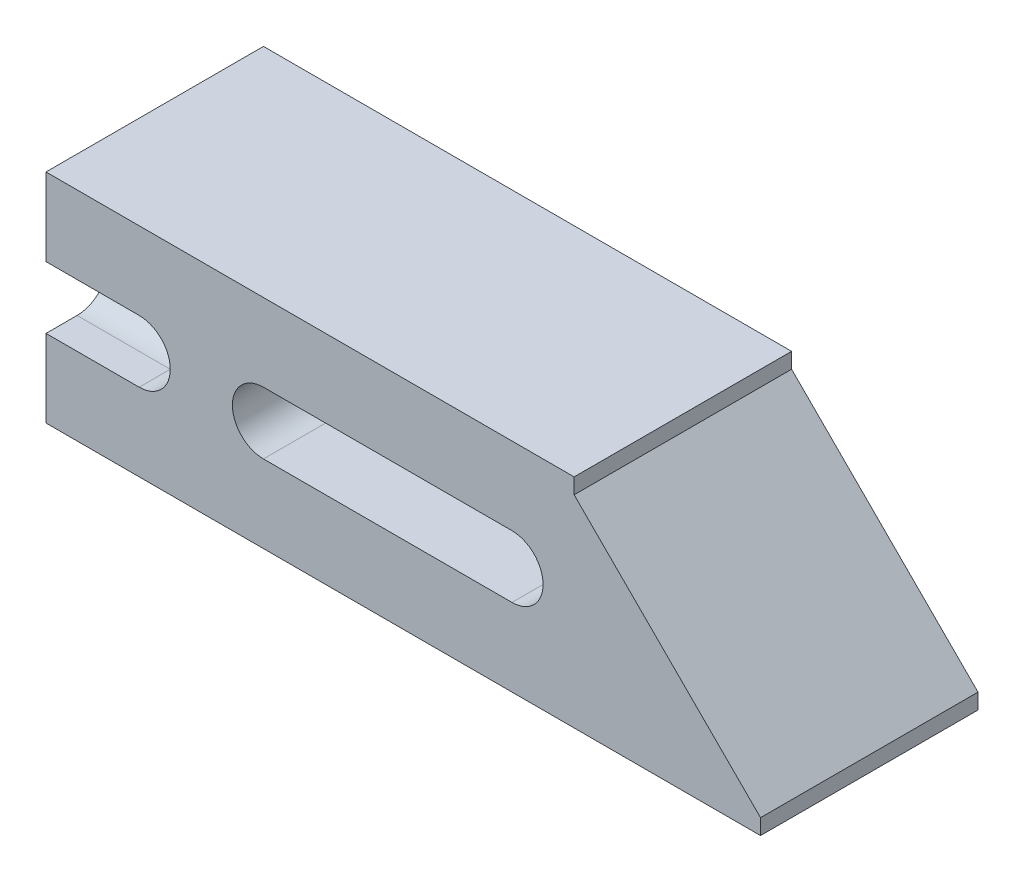
ISO-10303-21;
HEADER;
FILE_DESCRIPTION(('STEP AP214'),'2;1');
FILE_NAME('part.step','',(''),(''),'','','');
FILE_SCHEMA(('AUTOMOTIVE_DESIGN { 1 0 10303 214 1 1 1 1 }'));
ENDSEC;
DATA;
#1=APPLICATION_CONTEXT('core data for automotive mechanical design processes');
#2=APPLICATION_PROTOCOL_DEFINITION('international standard','automotive_design',2000,#1);
#3=PRODUCT_CONTEXT('',#1,'mechanical');
#4=PRODUCT('Part','Part','',(#3));
#5=PRODUCT_RELATED_PRODUCT_CATEGORY('part','',(#4));
#6=PRODUCT_DEFINITION_FORMATION('','',#4);
#7=PRODUCT_DEFINITION_CONTEXT('part definition',#1,'design');
#8=PRODUCT_DEFINITION('design','',#6,#7);
#9=PRODUCT_DEFINITION_SHAPE('','',#8);
#10=(LENGTH_UNIT() NAMED_UNIT(*) SI_UNIT(.MILLI.,.METRE.));
#11=(NAMED_UNIT(*) PLANE_ANGLE_UNIT() SI_UNIT($,.RADIAN.));
#12=(NAMED_UNIT(*) SI_UNIT($,.STERADIAN.) SOLID_ANGLE_UNIT());
#13=UNCERTAINTY_MEASURE_WITH_UNIT(LENGTH_MEASURE(1.E-05),#10,'distance_accuracy_value','');
#14=(GEOMETRIC_REPRESENTATION_CONTEXT(3) GLOBAL_UNCERTAINTY_ASSIGNED_CONTEXT((#13)) GLOBAL_UNIT_ASSIGNED_CONTEXT((#10,
#11,#12)) REPRESENTATION_CONTEXT('',''));
#15=CARTESIAN_POINT('',(0.,0.,0.));
#16=DIRECTION('',(0.,0.,1.));
#17=DIRECTION('',(1.,0.,0.));
#18=AXIS2_PLACEMENT_3D('',#15,#16,#17);
#19=CARTESIAN_POINT('',(9.525,11.1125,-6.98500000000001));
#20=DIRECTION('',(0.,0.,1.));
#21=DIRECTION('',(1.,0.,0.));
#22=AXIS2_PLACEMENT_3D('',#19,#20,#21);
#23=CYLINDRICAL_SURFACE('',#22,3.175);
#24=DIRECTION('',(0.,0.,1.));
#25=VECTOR('',#24,1.);
#26=CARTESIAN_POINT('',(9.525,7.93749999999999,-6.98500000000001));
#27=LINE('',#26,#25);
#28=CARTESIAN_POINT('',(9.525,7.9375,19.05));
#29=VERTEX_POINT('',#28);
#30=CARTESIAN_POINT('',(9.52500000000001,7.9375,22.225));
#31=VERTEX_POINT('',#30);
#32=EDGE_CURVE('E183',#29,#31,#27,.T.);
#33=ORIENTED_EDGE('',*,*,#32,.T.);
#34=CARTESIAN_POINT('',(9.525,11.1125,22.225));
#35=DIRECTION('',(0.,0.,1.));
#36=DIRECTION('',(1.,0.,0.));
#37=AXIS2_PLACEMENT_3D('',#34,#35,#36);
#38=CIRCLE('',#37,3.175);
#39=CARTESIAN_POINT('',(9.525,14.2875,22.225));
#40=VERTEX_POINT('',#39);
#41=EDGE_CURVE('E177',#31,#40,#38,.T.);
#42=ORIENTED_EDGE('',*,*,#41,.T.);
#43=DIRECTION('',(0.,0.,1.));
#44=VECTOR('',#43,1.);
#45=CARTESIAN_POINT('',(9.525,14.2875,-6.98500000000002));
#46=LINE('',#45,#44);
#47=CARTESIAN_POINT('',(9.525,14.2875,19.05));
#48=VERTEX_POINT('',#47);
#49=EDGE_CURVE('E193',#48,#40,#46,.T.);
#50=ORIENTED_EDGE('',*,*,#49,.F.);
#51=CARTESIAN_POINT('',(9.525,11.1125,19.05));
#52=DIRECTION('',(-0.707106781186547,0.,0.707106781186547));
#53=DIRECTION('',(-0.707106781186547,0.,-0.707106781186547));
#54=AXIS2_PLACEMENT_3D('',#51,#52,#53);
#55=ELLIPSE('',#54,4.49012806053458,3.175);
#56=EDGE_CURVE('E191',#29,#48,#55,.F.);
#57=ORIENTED_EDGE('',*,*,#56,.F.);
#58=EDGE_LOOP('',(#33,#42,#50,#57));
#59=FACE_BOUND('',#58,.T.);
#60=DIRECTION('',(0.,0.,1.));
#61=VECTOR('',#60,1.);
#62=CARTESIAN_POINT('',(9.525,7.9375,-6.98500000000001));
#63=LINE('',#62,#61);
#64=CARTESIAN_POINT('',(9.525,7.9375,0.));
#65=VERTEX_POINT('',#64);
#66=CARTESIAN_POINT('',(9.52500000000001,7.9375,3.175));
#67=VERTEX_POINT('',#66);
#68=EDGE_CURVE('E164',#65,#67,#63,.T.);
#69=ORIENTED_EDGE('',*,*,#68,.T.);
#70=CARTESIAN_POINT('',(9.525,11.1125,3.175));
#71=DIRECTION('',(-0.707106781186547,0.,-0.707106781186547));
#72=DIRECTION('',(-0.707106781186547,0.,0.707106781186547));
#73=AXIS2_PLACEMENT_3D('',#70,#71,#72);
#74=ELLIPSE('',#73,4.49012806053458,3.175);
#75=CARTESIAN_POINT('',(9.525,14.2875,3.175));
#76=VERTEX_POINT('',#75);
#77=EDGE_CURVE('E174',#76,#67,#74,.F.);
#78=ORIENTED_EDGE('',*,*,#77,.F.);
#79=DIRECTION('',(0.,0.,1.));
#80=VECTOR('',#79,1.);
#81=CARTESIAN_POINT('',(9.525,14.2875,-6.98500000000001));
#82=LINE('',#81,#80);
#83=CARTESIAN_POINT('',(9.525,14.2875,0.));
#84=VERTEX_POINT('',#83);
#85=EDGE_CURVE('E178',#84,#76,#82,.T.);
#86=ORIENTED_EDGE('',*,*,#85,.F.);
#87=CARTESIAN_POINT('',(9.525,11.1125,0.));
#88=DIRECTION('',(0.,0.,-1.));
#89=DIRECTION('',(-1.,0.,0.));
#90=AXIS2_PLACEMENT_3D('',#87,#88,#89);
#91=CIRCLE('',#90,3.175);
#92=EDGE_CURVE('E182',#84,#65,#91,.T.);
#93=ORIENTED_EDGE('',*,*,#92,.T.);
#94=EDGE_LOOP('',(#69,#78,#86,#93));
#95=FACE_BOUND('',#94,.T.);
#96=ADVANCED_FACE('F36',(#59,#95),#23,.F.);
#97=CARTESIAN_POINT('',(73.025,0.,22.225));
#98=DIRECTION('',(0.,1.,0.));
#99=DIRECTION('',(-1.,0.,0.));
#100=AXIS2_PLACEMENT_3D('',#97,#98,#99);
#101=PLANE('',#100);
#102=DIRECTION('',(1.,0.,0.));
#103=VECTOR('',#102,1.);
#104=CARTESIAN_POINT('',(73.025,0.,0.));
#105=LINE('',#104,#103);
#106=CARTESIAN_POINT('',(0.,0.,0.));
#107=VERTEX_POINT('',#106);
#108=CARTESIAN_POINT('',(73.025,0.,0.));
#109=VERTEX_POINT('',#108);
#110=EDGE_CURVE('E248',#107,#109,#105,.T.);
#111=ORIENTED_EDGE('',*,*,#110,.T.);
#112=DIRECTION('',(0.,0.,-1.));
#113=VECTOR('',#112,1.);
#114=CARTESIAN_POINT('',(73.025,0.,22.225));
#115=LINE('',#114,#113);
#116=CARTESIAN_POINT('',(73.025,0.,22.225));
#117=VERTEX_POINT('',#116);
#118=EDGE_CURVE('E276',#117,#109,#115,.T.);
#119=ORIENTED_EDGE('',*,*,#118,.F.);
#120=DIRECTION('',(1.,0.,0.));
#121=VECTOR('',#120,1.);
#122=CARTESIAN_POINT('',(73.025,0.,22.225));
#123=LINE('',#122,#121);
#124=CARTESIAN_POINT('',(0.,0.,22.225));
#125=VERTEX_POINT('',#124);
#126=EDGE_CURVE('E231',#125,#117,#123,.T.);
#127=ORIENTED_EDGE('',*,*,#126,.F.);
#128=DIRECTION('',(0.,0.,-1.));
#129=VECTOR('',#128,1.);
#130=CARTESIAN_POINT('',(0.,0.,22.225));
#131=LINE('',#130,#129);
#132=EDGE_CURVE('E247',#125,#107,#131,.T.);
#133=ORIENTED_EDGE('',*,*,#132,.T.);
#134=EDGE_LOOP('',(#111,#119,#127,#133));
#135=FACE_BOUND('',#134,.T.);
#136=ADVANCED_FACE('F38',(#135),#101,.F.);
#137=CARTESIAN_POINT('',(73.025,1.5875,22.225));
#138=DIRECTION('',(-1.,0.,0.));
#139=DIRECTION('',(0.,0.,1.));
#140=AXIS2_PLACEMENT_3D('',#137,#138,#139);
#141=PLANE('',#140);
#142=DIRECTION('',(0.,1.,0.));
#143=VECTOR('',#142,1.);
#144=CARTESIAN_POINT('',(73.025,1.5875,0.));
#145=LINE('',#144,#143);
#146=CARTESIAN_POINT('',(73.025,1.5875,0.));
#147=VERTEX_POINT('',#146);
#148=EDGE_CURVE('E251',#109,#147,#145,.T.);
#149=ORIENTED_EDGE('',*,*,#148,.T.);
#150=DIRECTION('',(0.,0.,-1.));
#151=VECTOR('',#150,1.);
#152=CARTESIAN_POINT('',(73.025,1.5875,22.225));
#153=LINE('',#152,#151);
#154=CARTESIAN_POINT('',(73.025,1.5875,22.225));
#155=VERTEX_POINT('',#154);
#156=EDGE_CURVE('E273',#155,#147,#153,.T.);
#157=ORIENTED_EDGE('',*,*,#156,.F.);
#158=DIRECTION('',(0.,1.,0.));
#159=VECTOR('',#158,1.);
#160=CARTESIAN_POINT('',(73.025,1.5875,22.225));
#161=LINE('',#160,#159);
#162=EDGE_CURVE('E234',#117,#155,#161,.T.);
#163=ORIENTED_EDGE('',*,*,#162,.F.);
#164=ORIENTED_EDGE('',*,*,#118,.T.);
#165=EDGE_LOOP('',(#149,#157,#163,#164));
#166=FACE_BOUND('',#165,.T.);
#167=ADVANCED_FACE('F326',(#166),#141,.F.);
#168=CARTESIAN_POINT('',(53.975,20.6374999999998,22.225));
#169=DIRECTION('',(-0.707106781186543,-0.707106781186552,0.));
#170=DIRECTION('',(0.707106781186552,-0.707106781186543,0.));
#171=AXIS2_PLACEMENT_3D('',#168,#169,#170);
#172=PLANE('',#171);
#173=DIRECTION('',(-0.707106781186552,0.707106781186543,0.));
#174=VECTOR('',#173,1.);
#175=CARTESIAN_POINT('',(53.975,20.6374999999998,0.));
#176=LINE('',#175,#174);
#177=CARTESIAN_POINT('',(53.975,20.6374999999998,0.));
#178=VERTEX_POINT('',#177);
#179=EDGE_CURVE('E253',#147,#178,#176,.T.);
#180=ORIENTED_EDGE('',*,*,#179,.T.);
#181=DIRECTION('',(0.,0.,-1.));
#182=VECTOR('',#181,1.);
#183=CARTESIAN_POINT('',(53.975,20.6374999999998,22.225));
#184=LINE('',#183,#182);
#185=CARTESIAN_POINT('',(53.975,20.6374999999998,22.225));
#186=VERTEX_POINT('',#185);
#187=EDGE_CURVE('E270',#186,#178,#184,.T.);
#188=ORIENTED_EDGE('',*,*,#187,.F.);
#189=DIRECTION('',(-0.707106781186552,0.707106781186543,0.));
#190=VECTOR('',#189,1.);
#191=CARTESIAN_POINT('',(53.975,20.6374999999998,22.225));
#192=LINE('',#191,#190);
#193=EDGE_CURVE('E237',#155,#186,#192,.T.);
#194=ORIENTED_EDGE('',*,*,#193,.F.);
#195=ORIENTED_EDGE('',*,*,#156,.T.);
#196=EDGE_LOOP('',(#180,#188,#194,#195));
#197=FACE_BOUND('',#196,.T.);
#198=ADVANCED_FACE('F345',(#197),#172,.F.);
#199=CARTESIAN_POINT('',(53.975,22.225,22.225));
#200=DIRECTION('',(-1.,0.,0.));
#201=DIRECTION('',(0.,0.,1.));
#202=AXIS2_PLACEMENT_3D('',#199,#200,#201);
#203=PLANE('',#202);
#204=DIRECTION('',(0.,1.,0.));
#205=VECTOR('',#204,1.);
#206=CARTESIAN_POINT('',(53.975,22.225,0.));
#207=LINE('',#206,#205);
#208=CARTESIAN_POINT('',(53.975,22.225,0.));
#209=VERTEX_POINT('',#208);
#210=EDGE_CURVE('E255',#178,#209,#207,.T.);
#211=ORIENTED_EDGE('',*,*,#210,.T.);
#212=DIRECTION('',(0.,0.,-1.));
#213=VECTOR('',#212,1.);
#214=CARTESIAN_POINT('',(53.975,22.225,22.225));
#215=LINE('',#214,#213);
#216=CARTESIAN_POINT('',(53.975,22.225,22.225));
#217=VERTEX_POINT('',#216);
#218=EDGE_CURVE('E267',#217,#209,#215,.T.);
#219=ORIENTED_EDGE('',*,*,#218,.F.);
#220=DIRECTION('',(0.,1.,0.));
#221=VECTOR('',#220,1.);
#222=CARTESIAN_POINT('',(53.975,22.225,22.225));
#223=LINE('',#222,#221);
#224=EDGE_CURVE('E239',#186,#217,#223,.T.);
#225=ORIENTED_EDGE('',*,*,#224,.F.);
#226=ORIENTED_EDGE('',*,*,#187,.T.);
#227=EDGE_LOOP('',(#211,#219,#225,#226));
#228=FACE_BOUND('',#227,.T.);
#229=ADVANCED_FACE('F341',(#228),#203,.F.);
#230=CARTESIAN_POINT('',(0.,22.225,22.225));
#231=DIRECTION('',(0.,-1.,0.));
#232=DIRECTION('',(0.,0.,-1.));
#233=AXIS2_PLACEMENT_3D('',#230,#231,#232);
#234=PLANE('',#233);
#235=DIRECTION('',(-1.,0.,0.));
#236=VECTOR('',#235,1.);
#237=CARTESIAN_POINT('',(0.,22.225,0.));
#238=LINE('',#237,#236);
#239=CARTESIAN_POINT('',(0.,22.225,0.));
#240=VERTEX_POINT('',#239);
#241=EDGE_CURVE('E257',#209,#240,#238,.T.);
#242=ORIENTED_EDGE('',*,*,#241,.T.);
#243=DIRECTION('',(0.,0.,-1.));
#244=VECTOR('',#243,1.);
#245=CARTESIAN_POINT('',(0.,22.225,22.225));
#246=LINE('',#245,#244);
#247=CARTESIAN_POINT('',(0.,22.225,22.225));
#248=VERTEX_POINT('',#247);
#249=EDGE_CURVE('E264',#248,#240,#246,.T.);
#250=ORIENTED_EDGE('',*,*,#249,.F.);
#251=DIRECTION('',(-1.,0.,0.));
#252=VECTOR('',#251,1.);
#253=CARTESIAN_POINT('',(0.,22.225,22.225));
#254=LINE('',#253,#252);
#255=EDGE_CURVE('E241',#217,#248,#254,.T.);
#256=ORIENTED_EDGE('',*,*,#255,.F.);
#257=ORIENTED_EDGE('',*,*,#218,.T.);
#258=EDGE_LOOP('',(#242,#250,#256,#257));
#259=FACE_BOUND('',#258,.T.);
#260=ADVANCED_FACE('F337',(#259),#234,.F.);
#261=CARTESIAN_POINT('',(0.,0.,22.225));
#262=DIRECTION('',(1.,0.,0.));
#263=DIRECTION('',(0.,0.,-1.));
#264=AXIS2_PLACEMENT_3D('',#261,#262,#263);
#265=PLANE('',#264);
#266=CARTESIAN_POINT('',(0.,11.1125,3.175));
#267=DIRECTION('',(-1.,0.,0.));
#268=DIRECTION('',(0.,0.,1.));
#269=AXIS2_PLACEMENT_3D('',#266,#267,#268);
#270=CIRCLE('',#269,3.175);
#271=CARTESIAN_POINT('',(0.,7.9375,3.175));
#272=VERTEX_POINT('',#271);
#273=CARTESIAN_POINT('',(0.,14.2875,3.175));
#274=VERTEX_POINT('',#273);
#275=EDGE_CURVE('E375',#272,#274,#270,.T.);
#276=ORIENTED_EDGE('',*,*,#275,.F.);
#277=DIRECTION('',(0.,0.,1.));
#278=VECTOR('',#277,1.);
#279=CARTESIAN_POINT('',(0.,7.9375,0.));
#280=LINE('',#279,#278);
#281=CARTESIAN_POINT('',(0.,7.9375,0.));
#282=VERTEX_POINT('',#281);
#283=EDGE_CURVE('E167',#282,#272,#280,.T.);
#284=ORIENTED_EDGE('',*,*,#283,.F.);
#285=DIRECTION('',(0.,-1.,0.));
#286=VECTOR('',#285,1.);
#287=CARTESIAN_POINT('',(0.,0.,0.));
#288=LINE('',#287,#286);
#289=EDGE_CURVE('E259',#282,#107,#288,.T.);
#290=ORIENTED_EDGE('',*,*,#289,.T.);
#291=ORIENTED_EDGE('',*,*,#132,.F.);
#292=DIRECTION('',(0.,-1.,0.));
#293=VECTOR('',#292,1.);
#294=CARTESIAN_POINT('',(0.,0.,22.225));
#295=LINE('',#294,#293);
#296=CARTESIAN_POINT('',(0.,7.9375,22.225));
#297=VERTEX_POINT('',#296);
#298=EDGE_CURVE('E243',#297,#125,#295,.T.);
#299=ORIENTED_EDGE('',*,*,#298,.F.);
#300=DIRECTION('',(0.,0.,1.));
#301=VECTOR('',#300,1.);
#302=CARTESIAN_POINT('',(0.,7.9375,19.05));
#303=LINE('',#302,#301);
#304=CARTESIAN_POINT('',(0.,7.9375,19.05));
#305=VERTEX_POINT('',#304);
#306=EDGE_CURVE('E197',#305,#297,#303,.T.);
#307=ORIENTED_EDGE('',*,*,#306,.F.);
#308=CARTESIAN_POINT('',(0.,11.1125,19.05));
#309=DIRECTION('',(-1.,0.,0.));
#310=DIRECTION('',(0.,0.,1.));
#311=AXIS2_PLACEMENT_3D('',#308,#309,#310);
#312=CIRCLE('',#311,3.175);
#313=CARTESIAN_POINT('',(0.,14.2875,19.05));
#314=VERTEX_POINT('',#313);
#315=EDGE_CURVE('E195',#314,#305,#312,.T.);
#316=ORIENTED_EDGE('',*,*,#315,.F.);
#317=DIRECTION('',(0.,0.,-1.));
#318=VECTOR('',#317,1.);
#319=CARTESIAN_POINT('',(0.,14.2875,22.225));
#320=LINE('',#319,#318);
#321=CARTESIAN_POINT('',(0.,14.2875,22.225));
#322=VERTEX_POINT('',#321);
#323=EDGE_CURVE('E199',#322,#314,#320,.T.);
#324=ORIENTED_EDGE('',*,*,#323,.F.);
#325=EDGE_CURVE('E244',#248,#322,#295,.T.);
#326=ORIENTED_EDGE('',*,*,#325,.F.);
#327=ORIENTED_EDGE('',*,*,#249,.T.);
#328=CARTESIAN_POINT('',(0.,14.2875,0.));
#329=VERTEX_POINT('',#328);
#330=EDGE_CURVE('E235',#240,#329,#288,.T.);
#331=ORIENTED_EDGE('',*,*,#330,.T.);
#332=DIRECTION('',(0.,0.,-1.));
#333=VECTOR('',#332,1.);
#334=CARTESIAN_POINT('',(0.,14.2875,3.175));
#335=LINE('',#334,#333);
#336=EDGE_CURVE('E376',#274,#329,#335,.T.);
#337=ORIENTED_EDGE('',*,*,#336,.F.);
#338=EDGE_LOOP('',(#276,#284,#290,#291,#299,#307,#316,#324,#326,#327,#331,#337));
#339=FACE_BOUND('',#338,.T.);
#340=ADVANCED_FACE('F331',(#339),#265,.F.);
#341=CARTESIAN_POINT('',(0.,0.,22.225));
#342=DIRECTION('',(0.,0.,-1.));
#343=DIRECTION('',(-1.,0.,0.));
#344=AXIS2_PLACEMENT_3D('',#341,#342,#343);
#345=PLANE('',#344);
#346=DIRECTION('',(-1.,0.,0.));
#347=VECTOR('',#346,1.);
#348=CARTESIAN_POINT('',(47.625,7.9375,22.225));
#349=LINE('',#348,#347);
#350=CARTESIAN_POINT('',(47.625,7.9375,22.225));
#351=VERTEX_POINT('',#350);
#352=CARTESIAN_POINT('',(22.225,7.9375,22.225));
#353=VERTEX_POINT('',#352);
#354=EDGE_CURVE('E211',#351,#353,#349,.T.);
#355=ORIENTED_EDGE('',*,*,#354,.T.);
#356=CARTESIAN_POINT('',(22.225,11.1125,22.225));
#357=DIRECTION('',(0.,0.,1.));
#358=DIRECTION('',(1.,0.,0.));
#359=AXIS2_PLACEMENT_3D('',#356,#357,#358);
#360=CIRCLE('',#359,3.175);
#361=CARTESIAN_POINT('',(22.225,14.2875,22.225));
#362=VERTEX_POINT('',#361);
#363=EDGE_CURVE('E209',#362,#353,#360,.T.);
#364=ORIENTED_EDGE('',*,*,#363,.F.);
#365=DIRECTION('',(1.,0.,0.));
#366=VECTOR('',#365,1.);
#367=CARTESIAN_POINT('',(22.225,14.2875,22.225));
#368=LINE('',#367,#366);
#369=CARTESIAN_POINT('',(47.625,14.2875,22.225));
#370=VERTEX_POINT('',#369);
#371=EDGE_CURVE('E217',#362,#370,#368,.T.);
#372=ORIENTED_EDGE('',*,*,#371,.T.);
#373=CARTESIAN_POINT('',(47.625,11.1125,22.225));
#374=DIRECTION('',(0.,0.,1.));
#375=DIRECTION('',(1.,0.,0.));
#376=AXIS2_PLACEMENT_3D('',#373,#374,#375);
#377=CIRCLE('',#376,3.175);
#378=EDGE_CURVE('E214',#351,#370,#377,.T.);
#379=ORIENTED_EDGE('',*,*,#378,.F.);
#380=EDGE_LOOP('',(#355,#364,#372,#379));
#381=FACE_BOUND('',#380,.T.);
#382=ORIENTED_EDGE('',*,*,#41,.F.);
#383=DIRECTION('',(-1.,0.,0.));
#384=VECTOR('',#383,1.);
#385=CARTESIAN_POINT('',(73.026,7.9375,22.225));
#386=LINE('',#385,#384);
#387=EDGE_CURVE('E205',#31,#297,#386,.T.);
#388=ORIENTED_EDGE('',*,*,#387,.T.);
#389=ORIENTED_EDGE('',*,*,#298,.T.);
#390=ORIENTED_EDGE('',*,*,#126,.T.);
#391=ORIENTED_EDGE('',*,*,#162,.T.);
#392=ORIENTED_EDGE('',*,*,#193,.T.);
#393=ORIENTED_EDGE('',*,*,#224,.T.);
#394=ORIENTED_EDGE('',*,*,#255,.T.);
#395=ORIENTED_EDGE('',*,*,#325,.T.);
#396=DIRECTION('',(-1.,0.,0.));
#397=VECTOR('',#396,1.);
#398=CARTESIAN_POINT('',(73.026,14.2875,22.225));
#399=LINE('',#398,#397);
#400=EDGE_CURVE('E203',#40,#322,#399,.T.);
#401=ORIENTED_EDGE('',*,*,#400,.F.);
#402=EDGE_LOOP('',(#382,#388,#389,#390,#391,#392,#393,#394,#395,#401));
#403=FACE_BOUND('',#402,.T.);
#404=ADVANCED_FACE('F301',(#381,#403),#345,.F.);
#405=CARTESIAN_POINT('',(0.,0.,0.));
#406=DIRECTION('',(0.,0.,-1.));
#407=DIRECTION('',(-1.,0.,0.));
#408=AXIS2_PLACEMENT_3D('',#405,#406,#407);
#409=PLANE('',#408);
#410=DIRECTION('',(-1.,0.,0.));
#411=VECTOR('',#410,1.);
#412=CARTESIAN_POINT('',(73.026,7.9375,0.));
#413=LINE('',#412,#411);
#414=EDGE_CURVE('E373',#65,#282,#413,.T.);
#415=ORIENTED_EDGE('',*,*,#414,.F.);
#416=ORIENTED_EDGE('',*,*,#92,.F.);
#417=DIRECTION('',(-1.,0.,0.));
#418=VECTOR('',#417,1.);
#419=CARTESIAN_POINT('',(73.026,14.2875,0.));
#420=LINE('',#419,#418);
#421=EDGE_CURVE('E59',#84,#329,#420,.T.);
#422=ORIENTED_EDGE('',*,*,#421,.T.);
#423=ORIENTED_EDGE('',*,*,#330,.F.);
#424=ORIENTED_EDGE('',*,*,#241,.F.);
#425=ORIENTED_EDGE('',*,*,#210,.F.);
#426=ORIENTED_EDGE('',*,*,#179,.F.);
#427=ORIENTED_EDGE('',*,*,#148,.F.);
#428=ORIENTED_EDGE('',*,*,#110,.F.);
#429=ORIENTED_EDGE('',*,*,#289,.F.);
#430=EDGE_LOOP('',(#415,#416,#422,#423,#424,#425,#426,#427,#428,#429));
#431=FACE_BOUND('',#430,.T.);
#432=CARTESIAN_POINT('',(22.225,11.1125,0.));
#433=DIRECTION('',(0.,0.,-1.));
#434=DIRECTION('',(-1.,0.,0.));
#435=AXIS2_PLACEMENT_3D('',#432,#433,#434);
#436=CIRCLE('',#435,3.175);
#437=CARTESIAN_POINT('',(22.225,7.9375,0.));
#438=VERTEX_POINT('',#437);
#439=CARTESIAN_POINT('',(22.225,14.2875,0.));
#440=VERTEX_POINT('',#439);
#441=EDGE_CURVE('E11',#438,#440,#436,.T.);
#442=ORIENTED_EDGE('',*,*,#441,.F.);
#443=DIRECTION('',(1.,0.,0.));
#444=VECTOR('',#443,1.);
#445=CARTESIAN_POINT('',(0.,7.9375,0.));
#446=LINE('',#445,#444);
#447=CARTESIAN_POINT('',(47.625,7.9375,0.));
#448=VERTEX_POINT('',#447);
#449=EDGE_CURVE('E279',#438,#448,#446,.T.);
#450=ORIENTED_EDGE('',*,*,#449,.T.);
#451=CARTESIAN_POINT('',(47.625,11.1125,0.));
#452=DIRECTION('',(0.,0.,-1.));
#453=DIRECTION('',(-1.,0.,0.));
#454=AXIS2_PLACEMENT_3D('',#451,#452,#453);
#455=CIRCLE('',#454,3.175);
#456=CARTESIAN_POINT('',(47.625,14.2875,0.));
#457=VERTEX_POINT('',#456);
#458=EDGE_CURVE('E283',#457,#448,#455,.T.);
#459=ORIENTED_EDGE('',*,*,#458,.F.);
#460=DIRECTION('',(-1.,0.,0.));
#461=VECTOR('',#460,1.);
#462=CARTESIAN_POINT('',(0.,14.2875,0.));
#463=LINE('',#462,#461);
#464=EDGE_CURVE('E44',#457,#440,#463,.T.);
#465=ORIENTED_EDGE('',*,*,#464,.T.);
#466=EDGE_LOOP('',(#442,#450,#459,#465));
#467=FACE_BOUND('',#466,.T.);
#468=ADVANCED_FACE('F289',(#431,#467),#409,.T.);
#469=CARTESIAN_POINT('',(22.225,11.1125,-6.98500000000001));
#470=DIRECTION('',(0.,0.,1.));
#471=DIRECTION('',(1.,0.,0.));
#472=AXIS2_PLACEMENT_3D('',#469,#470,#471);
#473=CYLINDRICAL_SURFACE('',#472,3.175);
#474=ORIENTED_EDGE('',*,*,#441,.T.);
#475=DIRECTION('',(0.,0.,1.));
#476=VECTOR('',#475,1.);
#477=CARTESIAN_POINT('',(22.225,14.2875,-6.98500000000001));
#478=LINE('',#477,#476);
#479=EDGE_CURVE('E221',#440,#362,#478,.T.);
#480=ORIENTED_EDGE('',*,*,#479,.T.);
#481=ORIENTED_EDGE('',*,*,#363,.T.);
#482=DIRECTION('',(0.,0.,1.));
#483=VECTOR('',#482,1.);
#484=CARTESIAN_POINT('',(22.225,7.9375,-6.98500000000001));
#485=LINE('',#484,#483);
#486=EDGE_CURVE('E220',#438,#353,#485,.T.);
#487=ORIENTED_EDGE('',*,*,#486,.F.);
#488=EDGE_LOOP('',(#474,#480,#481,#487));
#489=FACE_BOUND('',#488,.T.);
#490=ADVANCED_FACE('F305',(#489),#473,.F.);
#491=CARTESIAN_POINT('',(22.225,14.2875,-6.98500000000001));
#492=DIRECTION('',(0.,-1.,0.));
#493=DIRECTION('',(0.,0.,-1.));
#494=AXIS2_PLACEMENT_3D('',#491,#492,#493);
#495=PLANE('',#494);
#496=DIRECTION('',(0.,0.,1.));
#497=VECTOR('',#496,1.);
#498=CARTESIAN_POINT('',(47.625,14.2875,-6.98500000000001));
#499=LINE('',#498,#497);
#500=EDGE_CURVE('E223',#457,#370,#499,.T.);
#501=ORIENTED_EDGE('',*,*,#500,.T.);
#502=ORIENTED_EDGE('',*,*,#371,.F.);
#503=ORIENTED_EDGE('',*,*,#479,.F.);
#504=ORIENTED_EDGE('',*,*,#464,.F.);
#505=EDGE_LOOP('',(#501,#502,#503,#504));
#506=FACE_BOUND('',#505,.T.);
#507=ADVANCED_FACE('F293',(#506),#495,.T.);
#508=CARTESIAN_POINT('',(47.625,11.1125,-6.98500000000001));
#509=DIRECTION('',(0.,0.,1.));
#510=DIRECTION('',(1.,0.,0.));
#511=AXIS2_PLACEMENT_3D('',#508,#509,#510);
#512=CYLINDRICAL_SURFACE('',#511,3.175);
#513=ORIENTED_EDGE('',*,*,#458,.T.);
#514=DIRECTION('',(0.,0.,1.));
#515=VECTOR('',#514,1.);
#516=CARTESIAN_POINT('',(47.625,7.9375,-6.98500000000001));
#517=LINE('',#516,#515);
#518=EDGE_CURVE('E225',#448,#351,#517,.T.);
#519=ORIENTED_EDGE('',*,*,#518,.T.);
#520=ORIENTED_EDGE('',*,*,#378,.T.);
#521=ORIENTED_EDGE('',*,*,#500,.F.);
#522=EDGE_LOOP('',(#513,#519,#520,#521));
#523=FACE_BOUND('',#522,.T.);
#524=ADVANCED_FACE('F296',(#523),#512,.F.);
#525=CARTESIAN_POINT('',(47.625,7.9375,-6.98500000000001));
#526=DIRECTION('',(0.,1.,0.));
#527=DIRECTION('',(0.,0.,1.));
#528=AXIS2_PLACEMENT_3D('',#525,#526,#527);
#529=PLANE('',#528);
#530=ORIENTED_EDGE('',*,*,#486,.T.);
#531=ORIENTED_EDGE('',*,*,#354,.F.);
#532=ORIENTED_EDGE('',*,*,#518,.F.);
#533=ORIENTED_EDGE('',*,*,#449,.F.);
#534=EDGE_LOOP('',(#530,#531,#532,#533));
#535=FACE_BOUND('',#534,.T.);
#536=ADVANCED_FACE('F307',(#535),#529,.T.);
#537=CARTESIAN_POINT('',(73.026,7.9375,19.05));
#538=DIRECTION('',(0.,-1.,0.));
#539=DIRECTION('',(0.,0.,-1.));
#540=AXIS2_PLACEMENT_3D('',#537,#538,#539);
#541=PLANE('',#540);
#542=DIRECTION('',(-1.,0.,0.));
#543=VECTOR('',#542,1.);
#544=CARTESIAN_POINT('',(73.026,7.9375,19.05));
#545=LINE('',#544,#543);
#546=EDGE_CURVE('E51',#29,#305,#545,.T.);
#547=ORIENTED_EDGE('',*,*,#546,.T.);
#548=ORIENTED_EDGE('',*,*,#306,.T.);
#549=ORIENTED_EDGE('',*,*,#387,.F.);
#550=ORIENTED_EDGE('',*,*,#32,.F.);
#551=EDGE_LOOP('',(#547,#548,#549,#550));
#552=FACE_BOUND('',#551,.T.);
#553=ADVANCED_FACE('F309',(#552),#541,.F.);
#554=CARTESIAN_POINT('',(73.026,14.2875,22.225));
#555=DIRECTION('',(0.,1.,0.));
#556=DIRECTION('',(0.,0.,1.));
#557=AXIS2_PLACEMENT_3D('',#554,#555,#556);
#558=PLANE('',#557);
#559=ORIENTED_EDGE('',*,*,#49,.T.);
#560=ORIENTED_EDGE('',*,*,#400,.T.);
#561=ORIENTED_EDGE('',*,*,#323,.T.);
#562=DIRECTION('',(-1.,0.,0.));
#563=VECTOR('',#562,1.);
#564=CARTESIAN_POINT('',(73.026,14.2875,19.05));
#565=LINE('',#564,#563);
#566=EDGE_CURVE('E186',#48,#314,#565,.T.);
#567=ORIENTED_EDGE('',*,*,#566,.F.);
#568=EDGE_LOOP('',(#559,#560,#561,#567));
#569=FACE_BOUND('',#568,.T.);
#570=ADVANCED_FACE('F315',(#569),#558,.F.);
#571=CARTESIAN_POINT('',(73.026,11.1125,19.05));
#572=DIRECTION('',(-1.,0.,0.));
#573=DIRECTION('',(0.,0.,1.));
#574=AXIS2_PLACEMENT_3D('',#571,#572,#573);
#575=CYLINDRICAL_SURFACE('',#574,3.175);
#576=ORIENTED_EDGE('',*,*,#56,.T.);
#577=ORIENTED_EDGE('',*,*,#566,.T.);
#578=ORIENTED_EDGE('',*,*,#315,.T.);
#579=ORIENTED_EDGE('',*,*,#546,.F.);
#580=EDGE_LOOP('',(#576,#577,#578,#579));
#581=FACE_BOUND('',#580,.T.);
#582=ADVANCED_FACE('F390',(#581),#575,.F.);
#583=CARTESIAN_POINT('',(73.026,7.9375,0.));
#584=DIRECTION('',(0.,-1.,0.));
#585=DIRECTION('',(0.,0.,-1.));
#586=AXIS2_PLACEMENT_3D('',#583,#584,#585);
#587=PLANE('',#586);
#588=ORIENTED_EDGE('',*,*,#414,.T.);
#589=ORIENTED_EDGE('',*,*,#283,.T.);
#590=DIRECTION('',(-1.,0.,0.));
#591=VECTOR('',#590,1.);
#592=CARTESIAN_POINT('',(73.026,7.9375,3.175));
#593=LINE('',#592,#591);
#594=EDGE_CURVE('E160',#67,#272,#593,.T.);
#595=ORIENTED_EDGE('',*,*,#594,.F.);
#596=ORIENTED_EDGE('',*,*,#68,.F.);
#597=EDGE_LOOP('',(#588,#589,#595,#596));
#598=FACE_BOUND('',#597,.T.);
#599=ADVANCED_FACE('F162',(#598),#587,.F.);
#600=CARTESIAN_POINT('',(73.026,11.1125,3.175));
#601=DIRECTION('',(-1.,0.,0.));
#602=DIRECTION('',(0.,0.,1.));
#603=AXIS2_PLACEMENT_3D('',#600,#601,#602);
#604=CYLINDRICAL_SURFACE('',#603,3.175);
#605=ORIENTED_EDGE('',*,*,#77,.T.);
#606=ORIENTED_EDGE('',*,*,#594,.T.);
#607=ORIENTED_EDGE('',*,*,#275,.T.);
#608=DIRECTION('',(-1.,0.,0.));
#609=VECTOR('',#608,1.);
#610=CARTESIAN_POINT('',(73.026,14.2875,3.175));
#611=LINE('',#610,#609);
#612=EDGE_CURVE('E171',#76,#274,#611,.T.);
#613=ORIENTED_EDGE('',*,*,#612,.F.);
#614=EDGE_LOOP('',(#605,#606,#607,#613));
#615=FACE_BOUND('',#614,.T.);
#616=ADVANCED_FACE('F175',(#615),#604,.F.);
#617=CARTESIAN_POINT('',(73.026,14.2875,3.175));
#618=DIRECTION('',(0.,1.,0.));
#619=DIRECTION('',(0.,0.,1.));
#620=AXIS2_PLACEMENT_3D('',#617,#618,#619);
#621=PLANE('',#620);
#622=ORIENTED_EDGE('',*,*,#85,.T.);
#623=ORIENTED_EDGE('',*,*,#612,.T.);
#624=ORIENTED_EDGE('',*,*,#336,.T.);
#625=ORIENTED_EDGE('',*,*,#421,.F.);
#626=EDGE_LOOP('',(#622,#623,#624,#625));
#627=FACE_BOUND('',#626,.T.);
#628=ADVANCED_FACE('F382',(#627),#621,.F.);
#629=CLOSED_SHELL('',(#96,#136,#167,#198,#229,#260,#340,#404,#468,#490,#507,#524,#536,#553,#570,
#582,#599,#616,#628));
#630=MANIFOLD_SOLID_BREP('B2',#629);
#631=ADVANCED_BREP_SHAPE_REPRESENTATION('',(#18,#630),#14);
#632=SHAPE_DEFINITION_REPRESENTATION(#9,#631);
ENDSEC;
END-ISO-10303-21;
